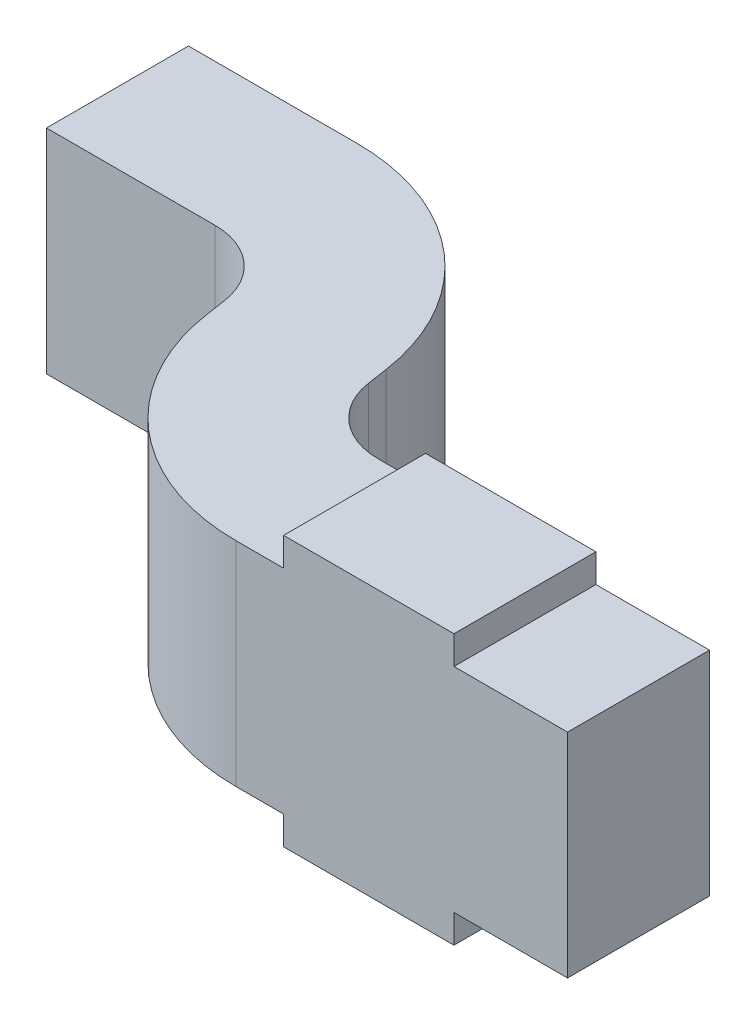
ISO-10303-21;
HEADER;
FILE_DESCRIPTION(('STEP AP214'),'2;1');
FILE_NAME('part.step','',(''),(''),'','','');
FILE_SCHEMA(('AUTOMOTIVE_DESIGN { 1 0 10303 214 1 1 1 1 }'));
ENDSEC;
DATA;
#1=APPLICATION_CONTEXT('core data for automotive mechanical design processes');
#2=APPLICATION_PROTOCOL_DEFINITION('international standard','automotive_design',2000,#1);
#3=PRODUCT_CONTEXT('',#1,'mechanical');
#4=PRODUCT('Part','Part','',(#3));
#5=PRODUCT_RELATED_PRODUCT_CATEGORY('part','',(#4));
#6=PRODUCT_DEFINITION_FORMATION('','',#4);
#7=PRODUCT_DEFINITION_CONTEXT('part definition',#1,'design');
#8=PRODUCT_DEFINITION('design','',#6,#7);
#9=PRODUCT_DEFINITION_SHAPE('','',#8);
#10=(LENGTH_UNIT() NAMED_UNIT(*) SI_UNIT(.MILLI.,.METRE.));
#11=(NAMED_UNIT(*) PLANE_ANGLE_UNIT() SI_UNIT($,.RADIAN.));
#12=(NAMED_UNIT(*) SI_UNIT($,.STERADIAN.) SOLID_ANGLE_UNIT());
#13=UNCERTAINTY_MEASURE_WITH_UNIT(LENGTH_MEASURE(1.E-05),#10,'distance_accuracy_value','');
#14=(GEOMETRIC_REPRESENTATION_CONTEXT(3) GLOBAL_UNCERTAINTY_ASSIGNED_CONTEXT((#13)) GLOBAL_UNIT_ASSIGNED_CONTEXT((#10,
#11,#12)) REPRESENTATION_CONTEXT('',''));
#15=CARTESIAN_POINT('',(0.,0.,0.));
#16=DIRECTION('',(0.,0.,1.));
#17=DIRECTION('',(1.,0.,0.));
#18=AXIS2_PLACEMENT_3D('',#15,#16,#17);
#19=CARTESIAN_POINT('',(-3.23,0.47500000000005,0.925));
#20=DIRECTION('',(0.,1.,0.));
#21=DIRECTION('',(1.,0.,0.));
#22=AXIS2_PLACEMENT_3D('',#19,#20,#21);
#23=PLANE('',#22);
#24=DIRECTION('',(1.,0.,0.));
#25=VECTOR('',#24,1.);
#26=CARTESIAN_POINT('',(-3.23,0.47500000000005,1.425));
#27=LINE('',#26,#25);
#28=CARTESIAN_POINT('',(-3.23,0.47500000000005,1.425));
#29=VERTEX_POINT('',#28);
#30=CARTESIAN_POINT('',(-2.63000000000008,0.47500000000005,1.425));
#31=VERTEX_POINT('',#30);
#32=EDGE_CURVE('E486',#29,#31,#27,.T.);
#33=ORIENTED_EDGE('',*,*,#32,.T.);
#34=DIRECTION('',(0.,0.,1.));
#35=VECTOR('',#34,1.);
#36=CARTESIAN_POINT('',(-2.63000000000008,0.47500000000005,0.925));
#37=LINE('',#36,#35);
#38=CARTESIAN_POINT('',(-2.63000000000008,0.47500000000005,0.925));
#39=VERTEX_POINT('',#38);
#40=EDGE_CURVE('E498',#39,#31,#37,.T.);
#41=ORIENTED_EDGE('',*,*,#40,.F.);
#42=DIRECTION('',(1.,0.,0.));
#43=VECTOR('',#42,1.);
#44=CARTESIAN_POINT('',(-3.23,0.47500000000005,0.925));
#45=LINE('',#44,#43);
#46=CARTESIAN_POINT('',(-3.23,0.47500000000005,0.925));
#47=VERTEX_POINT('',#46);
#48=EDGE_CURVE('E301',#47,#39,#45,.T.);
#49=ORIENTED_EDGE('',*,*,#48,.F.);
#50=DIRECTION('',(0.,0.,1.));
#51=VECTOR('',#50,1.);
#52=CARTESIAN_POINT('',(-3.23,0.47500000000005,0.925));
#53=LINE('',#52,#51);
#54=EDGE_CURVE('E367',#47,#29,#53,.T.);
#55=ORIENTED_EDGE('',*,*,#54,.T.);
#56=EDGE_LOOP('',(#33,#41,#49,#55));
#57=FACE_BOUND('',#56,.T.);
#58=ADVANCED_FACE('F17',(#57),#23,.T.);
#59=CARTESIAN_POINT('',(-3.23,-0.47499999999994,0.925));
#60=DIRECTION('',(-1.,0.,0.));
#61=DIRECTION('',(0.,0.,1.));
#62=AXIS2_PLACEMENT_3D('',#59,#60,#61);
#63=PLANE('',#62);
#64=DIRECTION('',(0.,0.,-1.));
#65=VECTOR('',#64,1.);
#66=CARTESIAN_POINT('',(-3.23,-0.375,0.85410254983609));
#67=LINE('',#66,#65);
#68=CARTESIAN_POINT('',(-3.23,-0.375,1.425));
#69=VERTEX_POINT('',#68);
#70=CARTESIAN_POINT('',(-3.23,-0.375,0.924999999999963));
#71=VERTEX_POINT('',#70);
#72=EDGE_CURVE('E372',#69,#71,#67,.T.);
#73=ORIENTED_EDGE('',*,*,#72,.T.);
#74=DIRECTION('',(0.,1.,0.));
#75=VECTOR('',#74,1.);
#76=CARTESIAN_POINT('',(-3.23,-0.47499999999994,0.925));
#77=LINE('',#76,#75);
#78=CARTESIAN_POINT('',(-3.23,-0.47499999999994,0.925));
#79=VERTEX_POINT('',#78);
#80=EDGE_CURVE('E281',#79,#71,#77,.T.);
#81=ORIENTED_EDGE('',*,*,#80,.F.);
#82=DIRECTION('',(0.,0.,1.));
#83=VECTOR('',#82,1.);
#84=CARTESIAN_POINT('',(-3.23,-0.47499999999994,0.925));
#85=LINE('',#84,#83);
#86=CARTESIAN_POINT('',(-3.23,-0.47499999999994,1.425));
#87=VERTEX_POINT('',#86);
#88=EDGE_CURVE('E11',#79,#87,#85,.T.);
#89=ORIENTED_EDGE('',*,*,#88,.T.);
#90=DIRECTION('',(0.,1.,0.));
#91=VECTOR('',#90,1.);
#92=CARTESIAN_POINT('',(-3.23,-0.47499999999994,1.425));
#93=LINE('',#92,#91);
#94=EDGE_CURVE('E490',#87,#69,#93,.T.);
#95=ORIENTED_EDGE('',*,*,#94,.T.);
#96=EDGE_LOOP('',(#73,#81,#89,#95));
#97=FACE_BOUND('',#96,.T.);
#98=ADVANCED_FACE('F794',(#97),#63,.T.);
#99=CARTESIAN_POINT('',(-2.63000000000008,-0.47499999999994,0.925));
#100=DIRECTION('',(0.,-1.,0.));
#101=DIRECTION('',(-1.,0.,0.));
#102=AXIS2_PLACEMENT_3D('',#99,#100,#101);
#103=PLANE('',#102);
#104=DIRECTION('',(-1.,0.,0.));
#105=VECTOR('',#104,1.);
#106=CARTESIAN_POINT('',(-2.63000000000008,-0.47499999999994,1.425));
#107=LINE('',#106,#105);
#108=CARTESIAN_POINT('',(-2.63000000000008,-0.47499999999994,1.425));
#109=VERTEX_POINT('',#108);
#110=EDGE_CURVE('E493',#109,#87,#107,.T.);
#111=ORIENTED_EDGE('',*,*,#110,.T.);
#112=ORIENTED_EDGE('',*,*,#88,.F.);
#113=DIRECTION('',(-1.,0.,0.));
#114=VECTOR('',#113,1.);
#115=CARTESIAN_POINT('',(-2.63000000000008,-0.47499999999994,0.925));
#116=LINE('',#115,#114);
#117=CARTESIAN_POINT('',(-2.63000000000008,-0.47499999999994,0.925));
#118=VERTEX_POINT('',#117);
#119=EDGE_CURVE('E278',#118,#79,#116,.T.);
#120=ORIENTED_EDGE('',*,*,#119,.F.);
#121=DIRECTION('',(0.,0.,1.));
#122=VECTOR('',#121,1.);
#123=CARTESIAN_POINT('',(-2.63000000000008,-0.47499999999994,0.925));
#124=LINE('',#123,#122);
#125=EDGE_CURVE('E20',#118,#109,#124,.T.);
#126=ORIENTED_EDGE('',*,*,#125,.T.);
#127=EDGE_LOOP('',(#111,#112,#120,#126));
#128=FACE_BOUND('',#127,.T.);
#129=ADVANCED_FACE('F782',(#128),#103,.T.);
#130=CARTESIAN_POINT('',(-2.63000000000008,0.47500000000005,0.925));
#131=DIRECTION('',(1.,0.,0.));
#132=DIRECTION('',(0.,-1.,0.));
#133=AXIS2_PLACEMENT_3D('',#130,#131,#132);
#134=PLANE('',#133);
#135=DIRECTION('',(0.,0.,1.));
#136=VECTOR('',#135,1.);
#137=CARTESIAN_POINT('',(-2.63000000000008,-0.375,0.85410254983609));
#138=LINE('',#137,#136);
#139=CARTESIAN_POINT('',(-2.63000000000008,-0.375,0.925));
#140=VERTEX_POINT('',#139);
#141=CARTESIAN_POINT('',(-2.63000000000008,-0.375,1.425));
#142=VERTEX_POINT('',#141);
#143=EDGE_CURVE('E333',#140,#142,#138,.T.);
#144=ORIENTED_EDGE('',*,*,#143,.T.);
#145=DIRECTION('',(0.,-1.,0.));
#146=VECTOR('',#145,1.);
#147=CARTESIAN_POINT('',(-2.63000000000008,0.47500000000005,1.425));
#148=LINE('',#147,#146);
#149=EDGE_CURVE('E496',#142,#109,#148,.T.);
#150=ORIENTED_EDGE('',*,*,#149,.T.);
#151=ORIENTED_EDGE('',*,*,#125,.F.);
#152=DIRECTION('',(0.,-1.,0.));
#153=VECTOR('',#152,1.);
#154=CARTESIAN_POINT('',(-2.63000000000008,0.47500000000005,0.925));
#155=LINE('',#154,#153);
#156=EDGE_CURVE('E282',#140,#118,#155,.T.);
#157=ORIENTED_EDGE('',*,*,#156,.F.);
#158=EDGE_LOOP('',(#144,#150,#151,#157));
#159=FACE_BOUND('',#158,.T.);
#160=ADVANCED_FACE('F771',(#159),#134,.T.);
#161=CARTESIAN_POINT('',(-2.63000000000008,0.47500000000005,0.925));
#162=DIRECTION('',(1.,0.,0.));
#163=DIRECTION('',(0.,-1.,0.));
#164=AXIS2_PLACEMENT_3D('',#161,#162,#163);
#165=PLANE('',#164);
#166=DIRECTION('',(0.,0.,-1.));
#167=VECTOR('',#166,1.);
#168=CARTESIAN_POINT('',(-2.63000000000008,0.375,0.85410254983609));
#169=LINE('',#168,#167);
#170=CARTESIAN_POINT('',(-2.63000000000008,0.375,1.425));
#171=VERTEX_POINT('',#170);
#172=CARTESIAN_POINT('',(-2.63000000000008,0.375,0.925));
#173=VERTEX_POINT('',#172);
#174=EDGE_CURVE('E416',#171,#173,#169,.T.);
#175=ORIENTED_EDGE('',*,*,#174,.T.);
#176=DIRECTION('',(0.,-1.,0.));
#177=VECTOR('',#176,1.);
#178=CARTESIAN_POINT('',(-2.63000000000008,0.47500000000005,0.925));
#179=LINE('',#178,#177);
#180=EDGE_CURVE('E305',#39,#173,#179,.T.);
#181=ORIENTED_EDGE('',*,*,#180,.F.);
#182=ORIENTED_EDGE('',*,*,#40,.T.);
#183=DIRECTION('',(0.,-1.,0.));
#184=VECTOR('',#183,1.);
#185=CARTESIAN_POINT('',(-2.63000000000008,0.47500000000005,1.425));
#186=LINE('',#185,#184);
#187=EDGE_CURVE('E483',#31,#171,#186,.T.);
#188=ORIENTED_EDGE('',*,*,#187,.T.);
#189=EDGE_LOOP('',(#175,#181,#182,#188));
#190=FACE_BOUND('',#189,.T.);
#191=ADVANCED_FACE('F759',(#190),#165,.T.);
#192=CARTESIAN_POINT('',(-2.93000000000004,0.,1.425));
#193=DIRECTION('',(0.,0.,1.));
#194=DIRECTION('',(1.,0.,0.));
#195=AXIS2_PLACEMENT_3D('',#192,#193,#194);
#196=PLANE('',#195);
#197=ORIENTED_EDGE('',*,*,#187,.F.);
#198=ORIENTED_EDGE('',*,*,#32,.F.);
#199=DIRECTION('',(0.,1.,0.));
#200=VECTOR('',#199,1.);
#201=CARTESIAN_POINT('',(-3.23,-0.47499999999994,1.425));
#202=LINE('',#201,#200);
#203=CARTESIAN_POINT('',(-3.23,0.375,1.425));
#204=VERTEX_POINT('',#203);
#205=EDGE_CURVE('E363',#204,#29,#202,.T.);
#206=ORIENTED_EDGE('',*,*,#205,.F.);
#207=DIRECTION('',(-1.,0.,0.));
#208=VECTOR('',#207,1.);
#209=CARTESIAN_POINT('',(-2.23000000000008,0.375,1.425));
#210=LINE('',#209,#208);
#211=CARTESIAN_POINT('',(-3.39710678118641,0.375,1.425));
#212=VERTEX_POINT('',#211);
#213=EDGE_CURVE('E368',#204,#212,#210,.T.);
#214=ORIENTED_EDGE('',*,*,#213,.T.);
#215=DIRECTION('',(0.,1.,0.));
#216=VECTOR('',#215,1.);
#217=CARTESIAN_POINT('',(-3.39710678118641,-0.375,1.425));
#218=LINE('',#217,#216);
#219=CARTESIAN_POINT('',(-3.39710678118641,-0.375,1.425));
#220=VERTEX_POINT('',#219);
#221=EDGE_CURVE('E426',#220,#212,#218,.T.);
#222=ORIENTED_EDGE('',*,*,#221,.F.);
#223=DIRECTION('',(-1.,0.,0.));
#224=VECTOR('',#223,1.);
#225=CARTESIAN_POINT('',(-2.23000000000008,-0.375,1.425));
#226=LINE('',#225,#224);
#227=EDGE_CURVE('E242',#69,#220,#226,.T.);
#228=ORIENTED_EDGE('',*,*,#227,.F.);
#229=ORIENTED_EDGE('',*,*,#94,.F.);
#230=ORIENTED_EDGE('',*,*,#110,.F.);
#231=ORIENTED_EDGE('',*,*,#149,.F.);
#232=DIRECTION('',(-1.,0.,0.));
#233=VECTOR('',#232,1.);
#234=CARTESIAN_POINT('',(-2.23000000000008,-0.375,1.425));
#235=LINE('',#234,#233);
#236=CARTESIAN_POINT('',(-2.23000000000008,-0.375,1.425));
#237=VERTEX_POINT('',#236);
#238=EDGE_CURVE('E327',#237,#142,#235,.T.);
#239=ORIENTED_EDGE('',*,*,#238,.F.);
#240=DIRECTION('',(0.,1.,0.));
#241=VECTOR('',#240,1.);
#242=CARTESIAN_POINT('',(-2.23000000000008,-0.375,1.425));
#243=LINE('',#242,#241);
#244=CARTESIAN_POINT('',(-2.23000000000008,0.375,1.425));
#245=VERTEX_POINT('',#244);
#246=EDGE_CURVE('E460',#237,#245,#243,.T.);
#247=ORIENTED_EDGE('',*,*,#246,.T.);
#248=DIRECTION('',(-1.,0.,0.));
#249=VECTOR('',#248,1.);
#250=CARTESIAN_POINT('',(-2.23000000000008,0.375,1.425));
#251=LINE('',#250,#249);
#252=EDGE_CURVE('E420',#245,#171,#251,.T.);
#253=ORIENTED_EDGE('',*,*,#252,.T.);
#254=EDGE_LOOP('',(#197,#198,#206,#214,#222,#228,#229,#230,#231,#239,#247,#253));
#255=FACE_BOUND('',#254,.T.);
#256=ADVANCED_FACE('F747',(#255),#196,.T.);
#257=CARTESIAN_POINT('',(-2.93000000000004,0.,0.925));
#258=DIRECTION('',(0.,0.,1.));
#259=DIRECTION('',(1.,0.,0.));
#260=AXIS2_PLACEMENT_3D('',#257,#258,#259);
#261=PLANE('',#260);
#262=ORIENTED_EDGE('',*,*,#156,.T.);
#263=ORIENTED_EDGE('',*,*,#119,.T.);
#264=ORIENTED_EDGE('',*,*,#80,.T.);
#265=DIRECTION('',(1.,0.,0.));
#266=VECTOR('',#265,1.);
#267=CARTESIAN_POINT('',(-3.39710678118641,-0.375,0.924999999999955));
#268=LINE('',#267,#266);
#269=CARTESIAN_POINT('',(-3.39710678118641,-0.375,0.924999999999955));
#270=VERTEX_POINT('',#269);
#271=EDGE_CURVE('E412',#270,#71,#268,.T.);
#272=ORIENTED_EDGE('',*,*,#271,.F.);
#273=DIRECTION('',(0.,1.,0.));
#274=VECTOR('',#273,1.);
#275=CARTESIAN_POINT('',(-3.39710678118641,-0.375,0.924999999999955));
#276=LINE('',#275,#274);
#277=CARTESIAN_POINT('',(-3.39710678118641,0.375,0.924999999999955));
#278=VERTEX_POINT('',#277);
#279=EDGE_CURVE('E276',#270,#278,#276,.T.);
#280=ORIENTED_EDGE('',*,*,#279,.T.);
#281=DIRECTION('',(1.,0.,0.));
#282=VECTOR('',#281,1.);
#283=CARTESIAN_POINT('',(-3.39710678118641,0.375,0.924999999999955));
#284=LINE('',#283,#282);
#285=CARTESIAN_POINT('',(-3.23,0.375,0.924999999999963));
#286=VERTEX_POINT('',#285);
#287=EDGE_CURVE('E346',#278,#286,#284,.T.);
#288=ORIENTED_EDGE('',*,*,#287,.T.);
#289=DIRECTION('',(0.,1.,0.));
#290=VECTOR('',#289,1.);
#291=CARTESIAN_POINT('',(-3.23,-0.47499999999994,0.925));
#292=LINE('',#291,#290);
#293=EDGE_CURVE('E447',#286,#47,#292,.T.);
#294=ORIENTED_EDGE('',*,*,#293,.T.);
#295=ORIENTED_EDGE('',*,*,#48,.T.);
#296=ORIENTED_EDGE('',*,*,#180,.T.);
#297=DIRECTION('',(1.,0.,0.));
#298=VECTOR('',#297,1.);
#299=CARTESIAN_POINT('',(-3.39710678118641,0.375,0.924999999999955));
#300=LINE('',#299,#298);
#301=CARTESIAN_POINT('',(-2.23000000000008,0.375,0.925000000000011));
#302=VERTEX_POINT('',#301);
#303=EDGE_CURVE('E292',#173,#302,#300,.T.);
#304=ORIENTED_EDGE('',*,*,#303,.T.);
#305=DIRECTION('',(0.,1.,0.));
#306=VECTOR('',#305,1.);
#307=CARTESIAN_POINT('',(-2.23000000000008,-0.375,0.925000000000011));
#308=LINE('',#307,#306);
#309=CARTESIAN_POINT('',(-2.23000000000008,-0.375,0.925000000000011));
#310=VERTEX_POINT('',#309);
#311=EDGE_CURVE('E463',#310,#302,#308,.T.);
#312=ORIENTED_EDGE('',*,*,#311,.F.);
#313=DIRECTION('',(1.,0.,0.));
#314=VECTOR('',#313,1.);
#315=CARTESIAN_POINT('',(-3.39710678118641,-0.375,0.924999999999955));
#316=LINE('',#315,#314);
#317=EDGE_CURVE('E328',#140,#310,#316,.T.);
#318=ORIENTED_EDGE('',*,*,#317,.F.);
#319=EDGE_LOOP('',(#262,#263,#264,#272,#280,#288,#294,#295,#296,#304,#312,#318));
#320=FACE_BOUND('',#319,.T.);
#321=ADVANCED_FACE('F735',(#320),#261,.F.);
#322=CARTESIAN_POINT('',(-3.23,-0.47499999999994,0.925));
#323=DIRECTION('',(-1.,0.,0.));
#324=DIRECTION('',(0.,0.,1.));
#325=AXIS2_PLACEMENT_3D('',#322,#323,#324);
#326=PLANE('',#325);
#327=DIRECTION('',(0.,0.,1.));
#328=VECTOR('',#327,1.);
#329=CARTESIAN_POINT('',(-3.23,0.375,0.85410254983609));
#330=LINE('',#329,#328);
#331=EDGE_CURVE('E342',#286,#204,#330,.T.);
#332=ORIENTED_EDGE('',*,*,#331,.T.);
#333=ORIENTED_EDGE('',*,*,#205,.T.);
#334=ORIENTED_EDGE('',*,*,#54,.F.);
#335=ORIENTED_EDGE('',*,*,#293,.F.);
#336=EDGE_LOOP('',(#332,#333,#334,#335));
#337=FACE_BOUND('',#336,.T.);
#338=ADVANCED_FACE('F723',(#337),#326,.T.);
#339=CARTESIAN_POINT('',(-3.64791907855811,0.375,0.78320509967218));
#340=DIRECTION('',(0.,-1.,0.));
#341=DIRECTION('',(-1.,0.,0.));
#342=AXIS2_PLACEMENT_3D('',#339,#340,#341);
#343=PLANE('',#342);
#344=ORIENTED_EDGE('',*,*,#331,.F.);
#345=ORIENTED_EDGE('',*,*,#287,.F.);
#346=CARTESIAN_POINT('',(-3.39710678118638,0.375,0.67499999999993));
#347=DIRECTION('',(0.,1.,0.));
#348=DIRECTION('',(-0.65224191465017,0.,0.758010873783141));
#349=AXIS2_PLACEMENT_3D('',#346,#347,#348);
#350=CIRCLE('',#349,0.250000000000025);
#351=CARTESIAN_POINT('',(-3.56016725984894,0.375,0.864502718445734));
#352=VERTEX_POINT('',#351);
#353=EDGE_CURVE('E272',#352,#278,#350,.T.);
#354=ORIENTED_EDGE('',*,*,#353,.F.);
#355=CARTESIAN_POINT('',(-3.39710678118638,0.375,0.67499999999993));
#356=DIRECTION('',(0.,1.,0.));
#357=DIRECTION('',(-0.65224191465017,0.,0.758010873783141));
#358=AXIS2_PLACEMENT_3D('',#355,#356,#357);
#359=CIRCLE('',#358,0.250000000000025);
#360=CARTESIAN_POINT('',(-3.64431001300739,0.375,0.7122902423867));
#361=VERTEX_POINT('',#360);
#362=EDGE_CURVE('E313',#361,#352,#359,.T.);
#363=ORIENTED_EDGE('',*,*,#362,.F.);
#364=DIRECTION('',(0.149160969547199,0.,0.988812927283892));
#365=VECTOR('',#364,1.);
#366=CARTESIAN_POINT('',(-3.65549708572354,0.375,0.638129272839649));
#367=LINE('',#366,#365);
#368=CARTESIAN_POINT('',(-3.65549708572354,0.375,0.638129272839649));
#369=VERTEX_POINT('',#368);
#370=EDGE_CURVE('E314',#369,#361,#367,.T.);
#371=ORIENTED_EDGE('',*,*,#370,.F.);
#372=CARTESIAN_POINT('',(-4.39710678118645,0.375,0.750000000000045));
#373=DIRECTION('',(0.,-1.,0.));
#374=DIRECTION('',(0.652241914650113,0.,-0.75801087378319));
#375=AXIS2_PLACEMENT_3D('',#372,#373,#374);
#376=CIRCLE('',#375,0.749999999999988);
#377=CARTESIAN_POINT('',(-3.90792534519888,0.375,0.181491844662661));
#378=VERTEX_POINT('',#377);
#379=EDGE_CURVE('E286',#378,#369,#376,.T.);
#380=ORIENTED_EDGE('',*,*,#379,.F.);
#381=CARTESIAN_POINT('',(-4.39710678118645,0.375,0.750000000000045));
#382=DIRECTION('',(0.,-1.,0.));
#383=DIRECTION('',(0.652241914650113,0.,-0.75801087378319));
#384=AXIS2_PLACEMENT_3D('',#381,#382,#383);
#385=CIRCLE('',#384,0.749999999999988);
#386=CARTESIAN_POINT('',(-4.39710678118638,0.375,0.));
#387=VERTEX_POINT('',#386);
#388=EDGE_CURVE('E455',#387,#378,#385,.T.);
#389=ORIENTED_EDGE('',*,*,#388,.F.);
#390=DIRECTION('',(1.,0.,0.));
#391=VECTOR('',#390,1.);
#392=CARTESIAN_POINT('',(-4.99,0.375,0.));
#393=LINE('',#392,#391);
#394=CARTESIAN_POINT('',(-4.99,0.375,0.));
#395=VERTEX_POINT('',#394);
#396=EDGE_CURVE('E270',#395,#387,#393,.T.);
#397=ORIENTED_EDGE('',*,*,#396,.F.);
#398=DIRECTION('',(0.,0.,-1.));
#399=VECTOR('',#398,1.);
#400=CARTESIAN_POINT('',(-4.99,0.375,0.499999999999943));
#401=LINE('',#400,#399);
#402=CARTESIAN_POINT('',(-4.99,0.375,0.499999999999943));
#403=VERTEX_POINT('',#402);
#404=EDGE_CURVE('E377',#403,#395,#401,.T.);
#405=ORIENTED_EDGE('',*,*,#404,.F.);
#406=DIRECTION('',(-1.,0.,-6.71122420360616E-13));
#407=VECTOR('',#406,1.);
#408=CARTESIAN_POINT('',(-4.39710678118624,0.375,0.500000000000341));
#409=LINE('',#408,#407);
#410=CARTESIAN_POINT('',(-4.39710678118624,0.375,0.500000000000341));
#411=VERTEX_POINT('',#410);
#412=EDGE_CURVE('E430',#411,#403,#409,.T.);
#413=ORIENTED_EDGE('',*,*,#412,.F.);
#414=CARTESIAN_POINT('',(-4.39710678118642,0.375,0.750000000000349));
#415=DIRECTION('',(0.,1.,0.));
#416=DIRECTION('',(0.652241914650429,0.,-0.758010873782918));
#417=AXIS2_PLACEMENT_3D('',#414,#415,#416);
#418=CIRCLE('',#417,0.250000000000008);
#419=CARTESIAN_POINT('',(-4.2340463025238,0.375,0.560497281554614));
#420=VERTEX_POINT('',#419);
#421=EDGE_CURVE('E334',#420,#411,#418,.T.);
#422=ORIENTED_EDGE('',*,*,#421,.F.);
#423=CARTESIAN_POINT('',(-4.39710678118642,0.375,0.750000000000349));
#424=DIRECTION('',(0.,1.,0.));
#425=DIRECTION('',(0.652241914650429,0.,-0.758010873782918));
#426=AXIS2_PLACEMENT_3D('',#423,#424,#425);
#427=CIRCLE('',#426,0.250000000000008);
#428=CARTESIAN_POINT('',(-4.14990354936543,0.375,0.712709757613595));
#429=VERTEX_POINT('',#428);
#430=EDGE_CURVE('E427',#429,#420,#427,.T.);
#431=ORIENTED_EDGE('',*,*,#430,.F.);
#432=DIRECTION('',(-0.149160969547128,0.,-0.988812927283903));
#433=VECTOR('',#432,1.);
#434=CARTESIAN_POINT('',(-4.13871647664934,0.375,0.786870727160306));
#435=LINE('',#434,#433);
#436=CARTESIAN_POINT('',(-4.13871647664934,0.375,0.786870727160306));
#437=VERTEX_POINT('',#436);
#438=EDGE_CURVE('E347',#437,#429,#435,.T.);
#439=ORIENTED_EDGE('',*,*,#438,.F.);
#440=CARTESIAN_POINT('',(-3.3971067811864,0.375,0.67500000000001));
#441=DIRECTION('',(0.,-1.,0.));
#442=DIRECTION('',(-0.652241914650137,0.,0.758010873783169));
#443=AXIS2_PLACEMENT_3D('',#440,#441,#442);
#444=CIRCLE('',#443,0.75);
#445=CARTESIAN_POINT('',(-3.886288217174,0.375,1.24350815533739));
#446=VERTEX_POINT('',#445);
#447=EDGE_CURVE('E257',#446,#437,#444,.T.);
#448=ORIENTED_EDGE('',*,*,#447,.F.);
#449=CARTESIAN_POINT('',(-3.3971067811864,0.375,0.67500000000001));
#450=DIRECTION('',(0.,-1.,0.));
#451=DIRECTION('',(-0.652241914650137,0.,0.758010873783169));
#452=AXIS2_PLACEMENT_3D('',#449,#450,#451);
#453=CIRCLE('',#452,0.75);
#454=EDGE_CURVE('E252',#212,#446,#453,.T.);
#455=ORIENTED_EDGE('',*,*,#454,.F.);
#456=ORIENTED_EDGE('',*,*,#213,.F.);
#457=EDGE_LOOP('',(#344,#345,#354,#363,#371,#380,#389,#397,#405,#413,#422,#431,#439,#448,#455,#456));
#458=FACE_BOUND('',#457,.T.);
#459=ADVANCED_FACE('F711',(#458),#343,.F.);
#460=CARTESIAN_POINT('',(-4.13871647664934,-0.375,0.786870727160306));
#461=DIRECTION('',(-0.988812927283903,0.,0.149160969547128));
#462=DIRECTION('',(0.,1.,0.));
#463=AXIS2_PLACEMENT_3D('',#460,#461,#462);
#464=PLANE('',#463);
#465=ORIENTED_EDGE('',*,*,#438,.T.);
#466=DIRECTION('',(0.,1.,0.));
#467=VECTOR('',#466,1.);
#468=CARTESIAN_POINT('',(-4.14990354936544,-0.375,0.712709757613595));
#469=LINE('',#468,#467);
#470=CARTESIAN_POINT('',(-4.14990354936544,-0.375,0.712709757613595));
#471=VERTEX_POINT('',#470);
#472=EDGE_CURVE('E296',#471,#429,#469,.T.);
#473=ORIENTED_EDGE('',*,*,#472,.F.);
#474=DIRECTION('',(-0.149160969547128,0.,-0.988812927283903));
#475=VECTOR('',#474,1.);
#476=CARTESIAN_POINT('',(-4.13871647664934,-0.375,0.786870727160306));
#477=LINE('',#476,#475);
#478=CARTESIAN_POINT('',(-4.13871647664934,-0.375,0.786870727160306));
#479=VERTEX_POINT('',#478);
#480=EDGE_CURVE('E246',#479,#471,#477,.T.);
#481=ORIENTED_EDGE('',*,*,#480,.F.);
#482=DIRECTION('',(0.,1.,0.));
#483=VECTOR('',#482,1.);
#484=CARTESIAN_POINT('',(-4.13871647664934,-0.375,0.786870727160306));
#485=LINE('',#484,#483);
#486=EDGE_CURVE('E262',#479,#437,#485,.T.);
#487=ORIENTED_EDGE('',*,*,#486,.T.);
#488=EDGE_LOOP('',(#465,#473,#481,#487));
#489=FACE_BOUND('',#488,.T.);
#490=ADVANCED_FACE('F700',(#489),#464,.T.);
#491=CARTESIAN_POINT('',(-3.3971067811864,-0.375,0.67500000000001));
#492=DIRECTION('',(0.,1.,0.));
#493=DIRECTION('',(-0.652241914650137,0.,0.758010873783169));
#494=AXIS2_PLACEMENT_3D('',#491,#492,#493);
#495=CYLINDRICAL_SURFACE('',#494,0.75);
#496=DIRECTION('',(0.,1.,0.));
#497=VECTOR('',#496,1.);
#498=CARTESIAN_POINT('',(-3.886288217174,-0.375,1.24350815533739));
#499=LINE('',#498,#497);
#500=CARTESIAN_POINT('',(-3.886288217174,-0.375,1.24350815533739));
#501=VERTEX_POINT('',#500);
#502=EDGE_CURVE('E249',#501,#446,#499,.T.);
#503=ORIENTED_EDGE('',*,*,#502,.F.);
#504=CARTESIAN_POINT('',(-3.3971067811864,-0.375,0.67500000000001));
#505=DIRECTION('',(0.,-1.,0.));
#506=DIRECTION('',(-0.652241914650137,0.,0.758010873783169));
#507=AXIS2_PLACEMENT_3D('',#504,#505,#506);
#508=CIRCLE('',#507,0.75);
#509=EDGE_CURVE('E234',#220,#501,#508,.T.);
#510=ORIENTED_EDGE('',*,*,#509,.F.);
#511=ORIENTED_EDGE('',*,*,#221,.T.);
#512=ORIENTED_EDGE('',*,*,#454,.T.);
#513=EDGE_LOOP('',(#503,#510,#511,#512));
#514=FACE_BOUND('',#513,.T.);
#515=ADVANCED_FACE('F250',(#514),#495,.T.);
#516=CARTESIAN_POINT('',(-2.23000000000008,-0.375,0.925000000000011));
#517=DIRECTION('',(1.,0.,0.));
#518=DIRECTION('',(0.,-1.,0.));
#519=AXIS2_PLACEMENT_3D('',#516,#517,#518);
#520=PLANE('',#519);
#521=DIRECTION('',(0.,0.,1.));
#522=VECTOR('',#521,1.);
#523=CARTESIAN_POINT('',(-2.23000000000008,0.375,0.925000000000011));
#524=LINE('',#523,#522);
#525=EDGE_CURVE('E297',#302,#245,#524,.T.);
#526=ORIENTED_EDGE('',*,*,#525,.T.);
#527=ORIENTED_EDGE('',*,*,#246,.F.);
#528=DIRECTION('',(0.,0.,1.));
#529=VECTOR('',#528,1.);
#530=CARTESIAN_POINT('',(-2.23000000000008,-0.375,0.925000000000011));
#531=LINE('',#530,#529);
#532=EDGE_CURVE('E323',#310,#237,#531,.T.);
#533=ORIENTED_EDGE('',*,*,#532,.F.);
#534=ORIENTED_EDGE('',*,*,#311,.T.);
#535=EDGE_LOOP('',(#526,#527,#533,#534));
#536=FACE_BOUND('',#535,.T.);
#537=ADVANCED_FACE('F678',(#536),#520,.T.);
#538=CARTESIAN_POINT('',(-3.39710678118638,-0.375,0.67499999999993));
#539=DIRECTION('',(0.,1.,0.));
#540=DIRECTION('',(-0.65224191465017,0.,0.758010873783141));
#541=AXIS2_PLACEMENT_3D('',#538,#539,#540);
#542=CYLINDRICAL_SURFACE('',#541,0.250000000000025);
#543=DIRECTION('',(0.,1.,0.));
#544=VECTOR('',#543,1.);
#545=CARTESIAN_POINT('',(-3.56016725984894,-0.375,0.864502718445734));
#546=LINE('',#545,#544);
#547=CARTESIAN_POINT('',(-3.56016725984894,-0.375,0.864502718445734));
#548=VERTEX_POINT('',#547);
#549=EDGE_CURVE('E277',#548,#352,#546,.T.);
#550=ORIENTED_EDGE('',*,*,#549,.F.);
#551=CARTESIAN_POINT('',(-3.39710678118638,-0.375,0.67499999999993));
#552=DIRECTION('',(0.,1.,0.));
#553=DIRECTION('',(-0.65224191465017,0.,0.758010873783141));
#554=AXIS2_PLACEMENT_3D('',#551,#552,#553);
#555=CIRCLE('',#554,0.250000000000025);
#556=CARTESIAN_POINT('',(-3.64431001300739,-0.375,0.7122902423867));
#557=VERTEX_POINT('',#556);
#558=EDGE_CURVE('E409',#557,#548,#555,.T.);
#559=ORIENTED_EDGE('',*,*,#558,.F.);
#560=DIRECTION('',(0.,1.,0.));
#561=VECTOR('',#560,1.);
#562=CARTESIAN_POINT('',(-3.64431001300739,-0.375,0.7122902423867));
#563=LINE('',#562,#561);
#564=EDGE_CURVE('E309',#557,#361,#563,.T.);
#565=ORIENTED_EDGE('',*,*,#564,.T.);
#566=ORIENTED_EDGE('',*,*,#362,.T.);
#567=EDGE_LOOP('',(#550,#559,#565,#566));
#568=FACE_BOUND('',#567,.T.);
#569=ADVANCED_FACE('F667',(#568),#542,.F.);
#570=CARTESIAN_POINT('',(-3.65549708572354,-0.375,0.638129272839649));
#571=DIRECTION('',(0.988812927283892,0.,-0.149160969547199));
#572=DIRECTION('',(0.,-1.,0.));
#573=AXIS2_PLACEMENT_3D('',#570,#571,#572);
#574=PLANE('',#573);
#575=ORIENTED_EDGE('',*,*,#370,.T.);
#576=ORIENTED_EDGE('',*,*,#564,.F.);
#577=DIRECTION('',(0.149160969547199,0.,0.988812927283892));
#578=VECTOR('',#577,1.);
#579=CARTESIAN_POINT('',(-3.65549708572354,-0.375,0.638129272839649));
#580=LINE('',#579,#578);
#581=CARTESIAN_POINT('',(-3.65549708572354,-0.375,0.638129272839649));
#582=VERTEX_POINT('',#581);
#583=EDGE_CURVE('E388',#582,#557,#580,.T.);
#584=ORIENTED_EDGE('',*,*,#583,.F.);
#585=DIRECTION('',(0.,1.,0.));
#586=VECTOR('',#585,1.);
#587=CARTESIAN_POINT('',(-3.65549708572354,-0.375,0.638129272839649));
#588=LINE('',#587,#586);
#589=EDGE_CURVE('E290',#582,#369,#588,.T.);
#590=ORIENTED_EDGE('',*,*,#589,.T.);
#591=EDGE_LOOP('',(#575,#576,#584,#590));
#592=FACE_BOUND('',#591,.T.);
#593=ADVANCED_FACE('F655',(#592),#574,.T.);
#594=CARTESIAN_POINT('',(-4.39710678118645,-0.375,0.750000000000045));
#595=DIRECTION('',(0.,1.,0.));
#596=DIRECTION('',(0.652241914650113,0.,-0.75801087378319));
#597=AXIS2_PLACEMENT_3D('',#594,#595,#596);
#598=CYLINDRICAL_SURFACE('',#597,0.749999999999988);
#599=DIRECTION('',(0.,1.,0.));
#600=VECTOR('',#599,1.);
#601=CARTESIAN_POINT('',(-3.90792534519888,-0.375,0.181491844662661));
#602=LINE('',#601,#600);
#603=CARTESIAN_POINT('',(-3.90792534519888,-0.375,0.181491844662661));
#604=VERTEX_POINT('',#603);
#605=EDGE_CURVE('E291',#604,#378,#602,.T.);
#606=ORIENTED_EDGE('',*,*,#605,.F.);
#607=CARTESIAN_POINT('',(-4.39710678118645,-0.375,0.750000000000045));
#608=DIRECTION('',(0.,-1.,0.));
#609=DIRECTION('',(0.652241914650113,0.,-0.75801087378319));
#610=AXIS2_PLACEMENT_3D('',#607,#608,#609);
#611=CIRCLE('',#610,0.749999999999988);
#612=CARTESIAN_POINT('',(-4.39710678118638,-0.375,0.));
#613=VERTEX_POINT('',#612);
#614=EDGE_CURVE('E386',#613,#604,#611,.T.);
#615=ORIENTED_EDGE('',*,*,#614,.F.);
#616=DIRECTION('',(0.,1.,0.));
#617=VECTOR('',#616,1.);
#618=CARTESIAN_POINT('',(-4.39710678118638,-0.375,0.));
#619=LINE('',#618,#617);
#620=EDGE_CURVE('E451',#613,#387,#619,.T.);
#621=ORIENTED_EDGE('',*,*,#620,.T.);
#622=ORIENTED_EDGE('',*,*,#388,.T.);
#623=EDGE_LOOP('',(#606,#615,#621,#622));
#624=FACE_BOUND('',#623,.T.);
#625=ADVANCED_FACE('F643',(#624),#598,.T.);
#626=CARTESIAN_POINT('',(-4.99,-0.375,0.));
#627=DIRECTION('',(0.,0.,-1.));
#628=DIRECTION('',(0.,-1.,0.));
#629=AXIS2_PLACEMENT_3D('',#626,#627,#628);
#630=PLANE('',#629);
#631=ORIENTED_EDGE('',*,*,#396,.T.);
#632=ORIENTED_EDGE('',*,*,#620,.F.);
#633=DIRECTION('',(1.,0.,0.));
#634=VECTOR('',#633,1.);
#635=CARTESIAN_POINT('',(-4.99,-0.375,0.));
#636=LINE('',#635,#634);
#637=CARTESIAN_POINT('',(-4.99,-0.375,0.));
#638=VERTEX_POINT('',#637);
#639=EDGE_CURVE('E389',#638,#613,#636,.T.);
#640=ORIENTED_EDGE('',*,*,#639,.F.);
#641=DIRECTION('',(0.,1.,0.));
#642=VECTOR('',#641,1.);
#643=CARTESIAN_POINT('',(-4.99,-0.375,0.));
#644=LINE('',#643,#642);
#645=EDGE_CURVE('E373',#638,#395,#644,.T.);
#646=ORIENTED_EDGE('',*,*,#645,.T.);
#647=EDGE_LOOP('',(#631,#632,#640,#646));
#648=FACE_BOUND('',#647,.T.);
#649=ADVANCED_FACE('F630',(#648),#630,.T.);
#650=CARTESIAN_POINT('',(-4.99,-0.375,0.499999999999943));
#651=DIRECTION('',(-1.,0.,0.));
#652=DIRECTION('',(0.,0.,1.));
#653=AXIS2_PLACEMENT_3D('',#650,#651,#652);
#654=PLANE('',#653);
#655=ORIENTED_EDGE('',*,*,#404,.T.);
#656=ORIENTED_EDGE('',*,*,#645,.F.);
#657=DIRECTION('',(0.,0.,-1.));
#658=VECTOR('',#657,1.);
#659=CARTESIAN_POINT('',(-4.99,-0.375,0.499999999999943));
#660=LINE('',#659,#658);
#661=CARTESIAN_POINT('',(-4.99,-0.375,0.499999999999943));
#662=VERTEX_POINT('',#661);
#663=EDGE_CURVE('E399',#662,#638,#660,.T.);
#664=ORIENTED_EDGE('',*,*,#663,.F.);
#665=DIRECTION('',(0.,1.,0.));
#666=VECTOR('',#665,1.);
#667=CARTESIAN_POINT('',(-4.99,-0.375,0.499999999999943));
#668=LINE('',#667,#666);
#669=EDGE_CURVE('E437',#662,#403,#668,.T.);
#670=ORIENTED_EDGE('',*,*,#669,.T.);
#671=EDGE_LOOP('',(#655,#656,#664,#670));
#672=FACE_BOUND('',#671,.T.);
#673=ADVANCED_FACE('F619',(#672),#654,.T.);
#674=CARTESIAN_POINT('',(-4.39710678118624,-0.375,0.500000000000341));
#675=DIRECTION('',(-6.71122420360616E-13,0.,1.));
#676=DIRECTION('',(1.,0.,6.71122420360616E-13));
#677=AXIS2_PLACEMENT_3D('',#674,#675,#676);
#678=PLANE('',#677);
#679=ORIENTED_EDGE('',*,*,#412,.T.);
#680=ORIENTED_EDGE('',*,*,#669,.F.);
#681=DIRECTION('',(-1.,0.,-6.71122420360616E-13));
#682=VECTOR('',#681,1.);
#683=CARTESIAN_POINT('',(-4.39710678118624,-0.375,0.500000000000341));
#684=LINE('',#683,#682);
#685=CARTESIAN_POINT('',(-4.39710678118624,-0.375,0.500000000000341));
#686=VERTEX_POINT('',#685);
#687=EDGE_CURVE('E395',#686,#662,#684,.T.);
#688=ORIENTED_EDGE('',*,*,#687,.F.);
#689=DIRECTION('',(0.,1.,0.));
#690=VECTOR('',#689,1.);
#691=CARTESIAN_POINT('',(-4.39710678118624,-0.375,0.500000000000341));
#692=LINE('',#691,#690);
#693=EDGE_CURVE('E329',#686,#411,#692,.T.);
#694=ORIENTED_EDGE('',*,*,#693,.T.);
#695=EDGE_LOOP('',(#679,#680,#688,#694));
#696=FACE_BOUND('',#695,.T.);
#697=ADVANCED_FACE('F607',(#696),#678,.T.);
#698=CARTESIAN_POINT('',(-4.39710678118642,-0.375,0.750000000000349));
#699=DIRECTION('',(0.,1.,0.));
#700=DIRECTION('',(0.652241914650429,0.,-0.758010873782918));
#701=AXIS2_PLACEMENT_3D('',#698,#699,#700);
#702=CYLINDRICAL_SURFACE('',#701,0.250000000000008);
#703=DIRECTION('',(0.,1.,0.));
#704=VECTOR('',#703,1.);
#705=CARTESIAN_POINT('',(-4.2340463025238,-0.375,0.560497281554614));
#706=LINE('',#705,#704);
#707=CARTESIAN_POINT('',(-4.2340463025238,-0.375,0.560497281554614));
#708=VERTEX_POINT('',#707);
#709=EDGE_CURVE('E319',#708,#420,#706,.T.);
#710=ORIENTED_EDGE('',*,*,#709,.F.);
#711=CARTESIAN_POINT('',(-4.39710678118642,-0.375,0.750000000000349));
#712=DIRECTION('',(0.,1.,0.));
#713=DIRECTION('',(0.652241914650429,0.,-0.758010873782918));
#714=AXIS2_PLACEMENT_3D('',#711,#712,#713);
#715=CIRCLE('',#714,0.250000000000008);
#716=EDGE_CURVE('E383',#471,#708,#715,.T.);
#717=ORIENTED_EDGE('',*,*,#716,.F.);
#718=ORIENTED_EDGE('',*,*,#472,.T.);
#719=ORIENTED_EDGE('',*,*,#430,.T.);
#720=EDGE_LOOP('',(#710,#717,#718,#719));
#721=FACE_BOUND('',#720,.T.);
#722=ADVANCED_FACE('F595',(#721),#702,.F.);
#723=CARTESIAN_POINT('',(-3.64791907855811,0.375,0.78320509967218));
#724=DIRECTION('',(0.,-1.,0.));
#725=DIRECTION('',(-1.,0.,0.));
#726=AXIS2_PLACEMENT_3D('',#723,#724,#725);
#727=PLANE('',#726);
#728=ORIENTED_EDGE('',*,*,#174,.F.);
#729=ORIENTED_EDGE('',*,*,#252,.F.);
#730=ORIENTED_EDGE('',*,*,#525,.F.);
#731=ORIENTED_EDGE('',*,*,#303,.F.);
#732=EDGE_LOOP('',(#728,#729,#730,#731));
#733=FACE_BOUND('',#732,.T.);
#734=ADVANCED_FACE('F583',(#733),#727,.F.);
#735=CARTESIAN_POINT('',(-3.64791907855811,-0.375,0.78320509967218));
#736=DIRECTION('',(0.,-1.,0.));
#737=DIRECTION('',(-1.,0.,0.));
#738=AXIS2_PLACEMENT_3D('',#735,#736,#737);
#739=PLANE('',#738);
#740=ORIENTED_EDGE('',*,*,#72,.F.);
#741=ORIENTED_EDGE('',*,*,#227,.T.);
#742=ORIENTED_EDGE('',*,*,#509,.T.);
#743=CARTESIAN_POINT('',(-3.3971067811864,-0.375,0.67500000000001));
#744=DIRECTION('',(0.,-1.,0.));
#745=DIRECTION('',(-0.652241914650137,0.,0.758010873783169));
#746=AXIS2_PLACEMENT_3D('',#743,#744,#745);
#747=CIRCLE('',#746,0.75);
#748=EDGE_CURVE('E240',#501,#479,#747,.T.);
#749=ORIENTED_EDGE('',*,*,#748,.T.);
#750=ORIENTED_EDGE('',*,*,#480,.T.);
#751=ORIENTED_EDGE('',*,*,#716,.T.);
#752=CARTESIAN_POINT('',(-4.39710678118642,-0.375,0.750000000000349));
#753=DIRECTION('',(0.,1.,0.));
#754=DIRECTION('',(0.652241914650429,0.,-0.758010873782918));
#755=AXIS2_PLACEMENT_3D('',#752,#753,#754);
#756=CIRCLE('',#755,0.250000000000008);
#757=EDGE_CURVE('E315',#708,#686,#756,.T.);
#758=ORIENTED_EDGE('',*,*,#757,.T.);
#759=ORIENTED_EDGE('',*,*,#687,.T.);
#760=ORIENTED_EDGE('',*,*,#663,.T.);
#761=ORIENTED_EDGE('',*,*,#639,.T.);
#762=ORIENTED_EDGE('',*,*,#614,.T.);
#763=CARTESIAN_POINT('',(-4.39710678118645,-0.375,0.750000000000045));
#764=DIRECTION('',(0.,-1.,0.));
#765=DIRECTION('',(0.652241914650113,0.,-0.75801087378319));
#766=AXIS2_PLACEMENT_3D('',#763,#764,#765);
#767=CIRCLE('',#766,0.749999999999988);
#768=EDGE_CURVE('E335',#604,#582,#767,.T.);
#769=ORIENTED_EDGE('',*,*,#768,.T.);
#770=ORIENTED_EDGE('',*,*,#583,.T.);
#771=ORIENTED_EDGE('',*,*,#558,.T.);
#772=CARTESIAN_POINT('',(-3.39710678118638,-0.375,0.67499999999993));
#773=DIRECTION('',(0.,1.,0.));
#774=DIRECTION('',(-0.65224191465017,0.,0.758010873783141));
#775=AXIS2_PLACEMENT_3D('',#772,#773,#774);
#776=CIRCLE('',#775,0.250000000000025);
#777=EDGE_CURVE('E300',#548,#270,#776,.T.);
#778=ORIENTED_EDGE('',*,*,#777,.T.);
#779=ORIENTED_EDGE('',*,*,#271,.T.);
#780=EDGE_LOOP('',(#740,#741,#742,#749,#750,#751,#758,#759,#760,#761,#762,#769,#770,#771,#778,#779));
#781=FACE_BOUND('',#780,.T.);
#782=ADVANCED_FACE('F237',(#781),#739,.T.);
#783=CARTESIAN_POINT('',(-3.64791907855811,-0.375,0.78320509967218));
#784=DIRECTION('',(0.,-1.,0.));
#785=DIRECTION('',(-1.,0.,0.));
#786=AXIS2_PLACEMENT_3D('',#783,#784,#785);
#787=PLANE('',#786);
#788=ORIENTED_EDGE('',*,*,#143,.F.);
#789=ORIENTED_EDGE('',*,*,#317,.T.);
#790=ORIENTED_EDGE('',*,*,#532,.T.);
#791=ORIENTED_EDGE('',*,*,#238,.T.);
#792=EDGE_LOOP('',(#788,#789,#790,#791));
#793=FACE_BOUND('',#792,.T.);
#794=ADVANCED_FACE('F561',(#793),#787,.T.);
#795=CARTESIAN_POINT('',(-4.39710678118642,-0.375,0.750000000000349));
#796=DIRECTION('',(0.,1.,0.));
#797=DIRECTION('',(0.652241914650429,0.,-0.758010873782918));
#798=AXIS2_PLACEMENT_3D('',#795,#796,#797);
#799=CYLINDRICAL_SURFACE('',#798,0.250000000000008);
#800=ORIENTED_EDGE('',*,*,#757,.F.);
#801=ORIENTED_EDGE('',*,*,#709,.T.);
#802=ORIENTED_EDGE('',*,*,#421,.T.);
#803=ORIENTED_EDGE('',*,*,#693,.F.);
#804=EDGE_LOOP('',(#800,#801,#802,#803));
#805=FACE_BOUND('',#804,.T.);
#806=ADVANCED_FACE('F549',(#805),#799,.F.);
#807=CARTESIAN_POINT('',(-4.39710678118645,-0.375,0.750000000000045));
#808=DIRECTION('',(0.,1.,0.));
#809=DIRECTION('',(0.652241914650113,0.,-0.75801087378319));
#810=AXIS2_PLACEMENT_3D('',#807,#808,#809);
#811=CYLINDRICAL_SURFACE('',#810,0.749999999999988);
#812=ORIENTED_EDGE('',*,*,#768,.F.);
#813=ORIENTED_EDGE('',*,*,#605,.T.);
#814=ORIENTED_EDGE('',*,*,#379,.T.);
#815=ORIENTED_EDGE('',*,*,#589,.F.);
#816=EDGE_LOOP('',(#812,#813,#814,#815));
#817=FACE_BOUND('',#816,.T.);
#818=ADVANCED_FACE('F536',(#817),#811,.T.);
#819=CARTESIAN_POINT('',(-3.39710678118638,-0.375,0.67499999999993));
#820=DIRECTION('',(0.,1.,0.));
#821=DIRECTION('',(-0.65224191465017,0.,0.758010873783141));
#822=AXIS2_PLACEMENT_3D('',#819,#820,#821);
#823=CYLINDRICAL_SURFACE('',#822,0.250000000000025);
#824=ORIENTED_EDGE('',*,*,#777,.F.);
#825=ORIENTED_EDGE('',*,*,#549,.T.);
#826=ORIENTED_EDGE('',*,*,#353,.T.);
#827=ORIENTED_EDGE('',*,*,#279,.F.);
#828=EDGE_LOOP('',(#824,#825,#826,#827));
#829=FACE_BOUND('',#828,.T.);
#830=ADVANCED_FACE('F523',(#829),#823,.F.);
#831=CARTESIAN_POINT('',(-3.3971067811864,-0.375,0.67500000000001));
#832=DIRECTION('',(0.,1.,0.));
#833=DIRECTION('',(-0.652241914650137,0.,0.758010873783169));
#834=AXIS2_PLACEMENT_3D('',#831,#832,#833);
#835=CYLINDRICAL_SURFACE('',#834,0.75);
#836=ORIENTED_EDGE('',*,*,#748,.F.);
#837=ORIENTED_EDGE('',*,*,#502,.T.);
#838=ORIENTED_EDGE('',*,*,#447,.T.);
#839=ORIENTED_EDGE('',*,*,#486,.F.);
#840=EDGE_LOOP('',(#836,#837,#838,#839));
#841=FACE_BOUND('',#840,.T.);
#842=ADVANCED_FACE('F260',(#841),#835,.T.);
#843=CLOSED_SHELL('',(#58,#98,#129,#160,#191,#256,#321,#338,#459,#490,#515,#537,#569,#593,#625,
#649,#673,#697,#722,#734,#782,#794,#806,#818,#830,#842));
#844=MANIFOLD_SOLID_BREP('B1',#843);
#845=ADVANCED_BREP_SHAPE_REPRESENTATION('',(#18,#844),#14);
#846=SHAPE_DEFINITION_REPRESENTATION(#9,#845);
ENDSEC;
END-ISO-10303-21;
